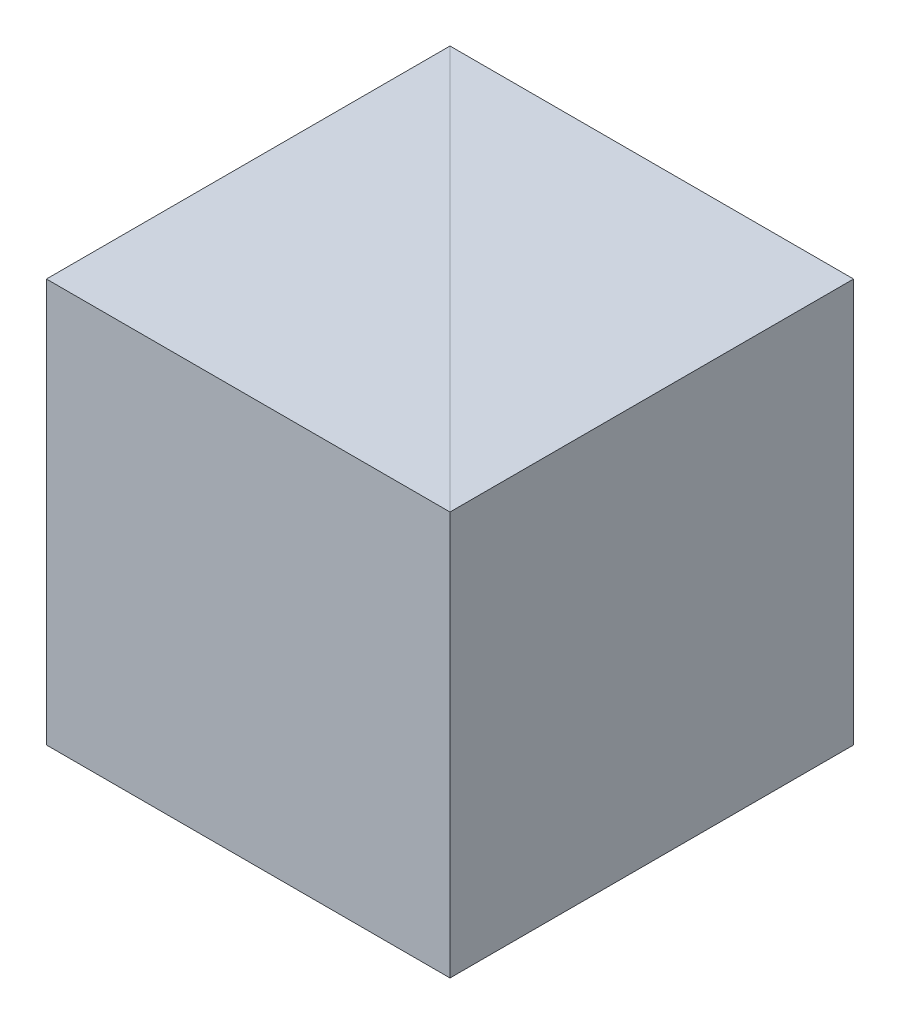
ISO-10303-21;
HEADER;
FILE_DESCRIPTION(('STEP AP214'),'2;1');
FILE_NAME('part.step','',(''),(''),'','','');
FILE_SCHEMA(('AUTOMOTIVE_DESIGN { 1 0 10303 214 1 1 1 1 }'));
ENDSEC;
DATA;
#1=APPLICATION_CONTEXT('core data for automotive mechanical design processes');
#2=APPLICATION_PROTOCOL_DEFINITION('international standard','automotive_design',2000,#1);
#3=PRODUCT_CONTEXT('',#1,'mechanical');
#4=PRODUCT('Part','Part','',(#3));
#5=PRODUCT_RELATED_PRODUCT_CATEGORY('part','',(#4));
#6=PRODUCT_DEFINITION_FORMATION('','',#4);
#7=PRODUCT_DEFINITION_CONTEXT('part definition',#1,'design');
#8=PRODUCT_DEFINITION('design','',#6,#7);
#9=PRODUCT_DEFINITION_SHAPE('','',#8);
#10=(LENGTH_UNIT() NAMED_UNIT(*) SI_UNIT(.MILLI.,.METRE.));
#11=(NAMED_UNIT(*) PLANE_ANGLE_UNIT() SI_UNIT($,.RADIAN.));
#12=(NAMED_UNIT(*) SI_UNIT($,.STERADIAN.) SOLID_ANGLE_UNIT());
#13=UNCERTAINTY_MEASURE_WITH_UNIT(LENGTH_MEASURE(1.E-05),#10,'distance_accuracy_value','');
#14=(GEOMETRIC_REPRESENTATION_CONTEXT(3) GLOBAL_UNCERTAINTY_ASSIGNED_CONTEXT((#13)) GLOBAL_UNIT_ASSIGNED_CONTEXT((#10,
#11,#12)) REPRESENTATION_CONTEXT('',''));
#15=CARTESIAN_POINT('',(0.,0.,0.));
#16=DIRECTION('',(0.,0.,1.));
#17=DIRECTION('',(1.,0.,0.));
#18=AXIS2_PLACEMENT_3D('',#15,#16,#17);
#19=CARTESIAN_POINT('',(0.,5.,0.));
#20=DIRECTION('',(0.707106781186547,0.,-0.707106781186548));
#21=DIRECTION('',(-0.707106781186548,0.,-0.707106781186547));
#22=AXIS2_PLACEMENT_3D('',#19,#20,#21);
#23=PLANE('',#22);
#24=DIRECTION('',(0.707106781186548,0.,0.707106781186547));
#25=VECTOR('',#24,1.);
#26=CARTESIAN_POINT('',(0.,0.,0.));
#27=LINE('',#26,#25);
#28=CARTESIAN_POINT('',(-5.,0.,-5.));
#29=VERTEX_POINT('',#28);
#30=CARTESIAN_POINT('',(0.,0.,0.));
#31=VERTEX_POINT('',#30);
#32=EDGE_CURVE('E97',#29,#31,#27,.T.);
#33=ORIENTED_EDGE('',*,*,#32,.F.);
#34=DIRECTION('',(0.,-1.,0.));
#35=VECTOR('',#34,1.);
#36=CARTESIAN_POINT('',(-5.,5.,-5.));
#37=LINE('',#36,#35);
#38=CARTESIAN_POINT('',(-5.,5.,-5.));
#39=VERTEX_POINT('',#38);
#40=EDGE_CURVE('E12',#39,#29,#37,.T.);
#41=ORIENTED_EDGE('',*,*,#40,.F.);
#42=DIRECTION('',(0.707106781186548,0.,0.707106781186547));
#43=VECTOR('',#42,1.);
#44=CARTESIAN_POINT('',(0.,5.,0.));
#45=LINE('',#44,#43);
#46=CARTESIAN_POINT('',(0.,5.,0.));
#47=VERTEX_POINT('',#46);
#48=EDGE_CURVE('E89',#39,#47,#45,.T.);
#49=ORIENTED_EDGE('',*,*,#48,.T.);
#50=DIRECTION('',(0.,-1.,0.));
#51=VECTOR('',#50,1.);
#52=CARTESIAN_POINT('',(0.,5.,0.));
#53=LINE('',#52,#51);
#54=EDGE_CURVE('E48',#47,#31,#53,.T.);
#55=ORIENTED_EDGE('',*,*,#54,.T.);
#56=EDGE_LOOP('',(#33,#41,#49,#55));
#57=FACE_BOUND('',#56,.T.);
#58=ADVANCED_FACE('F45',(#57),#23,.T.);
#59=CARTESIAN_POINT('',(-5.,5.,-5.));
#60=DIRECTION('',(-1.,0.,0.));
#61=DIRECTION('',(0.,0.,1.));
#62=AXIS2_PLACEMENT_3D('',#59,#60,#61);
#63=PLANE('',#62);
#64=DIRECTION('',(0.,0.,-1.));
#65=VECTOR('',#64,1.);
#66=CARTESIAN_POINT('',(-5.,0.,-5.));
#67=LINE('',#66,#65);
#68=CARTESIAN_POINT('',(-5.,0.,0.));
#69=VERTEX_POINT('',#68);
#70=EDGE_CURVE('E91',#69,#29,#67,.T.);
#71=ORIENTED_EDGE('',*,*,#70,.F.);
#72=DIRECTION('',(0.,-1.,0.));
#73=VECTOR('',#72,1.);
#74=CARTESIAN_POINT('',(-5.,5.,0.));
#75=LINE('',#74,#73);
#76=CARTESIAN_POINT('',(-5.,5.,0.));
#77=VERTEX_POINT('',#76);
#78=EDGE_CURVE('E54',#77,#69,#75,.T.);
#79=ORIENTED_EDGE('',*,*,#78,.F.);
#80=DIRECTION('',(0.,0.,-1.));
#81=VECTOR('',#80,1.);
#82=CARTESIAN_POINT('',(-5.,5.,-5.));
#83=LINE('',#82,#81);
#84=EDGE_CURVE('E86',#77,#39,#83,.T.);
#85=ORIENTED_EDGE('',*,*,#84,.T.);
#86=ORIENTED_EDGE('',*,*,#40,.T.);
#87=EDGE_LOOP('',(#71,#79,#85,#86));
#88=FACE_BOUND('',#87,.T.);
#89=ADVANCED_FACE('F101',(#88),#63,.T.);
#90=CARTESIAN_POINT('',(-5.,5.,0.));
#91=DIRECTION('',(0.,0.,1.));
#92=DIRECTION('',(1.,0.,0.));
#93=AXIS2_PLACEMENT_3D('',#90,#91,#92);
#94=PLANE('',#93);
#95=DIRECTION('',(-1.,0.,0.));
#96=VECTOR('',#95,1.);
#97=CARTESIAN_POINT('',(-5.,0.,0.));
#98=LINE('',#97,#96);
#99=EDGE_CURVE('E84',#31,#69,#98,.T.);
#100=ORIENTED_EDGE('',*,*,#99,.F.);
#101=ORIENTED_EDGE('',*,*,#54,.F.);
#102=DIRECTION('',(-1.,0.,0.));
#103=VECTOR('',#102,1.);
#104=CARTESIAN_POINT('',(-5.,5.,0.));
#105=LINE('',#104,#103);
#106=EDGE_CURVE('E82',#47,#77,#105,.T.);
#107=ORIENTED_EDGE('',*,*,#106,.T.);
#108=ORIENTED_EDGE('',*,*,#78,.T.);
#109=EDGE_LOOP('',(#100,#101,#107,#108));
#110=FACE_BOUND('',#109,.T.);
#111=ADVANCED_FACE('F81',(#110),#94,.T.);
#112=CARTESIAN_POINT('',(0.,5.,0.));
#113=DIRECTION('',(0.,1.,0.));
#114=DIRECTION('',(0.,0.,1.));
#115=AXIS2_PLACEMENT_3D('',#112,#113,#114);
#116=PLANE('',#115);
#117=ORIENTED_EDGE('',*,*,#48,.F.);
#118=ORIENTED_EDGE('',*,*,#84,.F.);
#119=ORIENTED_EDGE('',*,*,#106,.F.);
#120=EDGE_LOOP('',(#117,#118,#119));
#121=FACE_BOUND('',#120,.T.);
#122=ADVANCED_FACE('F88',(#121),#116,.T.);
#123=CARTESIAN_POINT('',(0.,0.,0.));
#124=DIRECTION('',(0.,1.,0.));
#125=DIRECTION('',(0.,0.,1.));
#126=AXIS2_PLACEMENT_3D('',#123,#124,#125);
#127=PLANE('',#126);
#128=ORIENTED_EDGE('',*,*,#32,.T.);
#129=ORIENTED_EDGE('',*,*,#99,.T.);
#130=ORIENTED_EDGE('',*,*,#70,.T.);
#131=EDGE_LOOP('',(#128,#129,#130));
#132=FACE_BOUND('',#131,.T.);
#133=ADVANCED_FACE('F100',(#132),#127,.F.);
#134=CLOSED_SHELL('',(#58,#89,#111,#122,#133));
#135=MANIFOLD_SOLID_BREP('B2',#134);
#136=CARTESIAN_POINT('',(-5.,5.,-5.));
#137=DIRECTION('',(0.707106781186547,0.,-0.707106781186548));
#138=DIRECTION('',(-0.707106781186548,0.,-0.707106781186547));
#139=AXIS2_PLACEMENT_3D('',#136,#137,#138);
#140=PLANE('',#139);
#141=DIRECTION('',(0.707106781186548,0.,0.707106781186547));
#142=VECTOR('',#141,1.);
#143=CARTESIAN_POINT('',(-5.,0.,-5.));
#144=LINE('',#143,#142);
#145=CARTESIAN_POINT('',(-5.,0.,-5.));
#146=VERTEX_POINT('',#145);
#147=CARTESIAN_POINT('',(0.,0.,0.));
#148=VERTEX_POINT('',#147);
#149=EDGE_CURVE('E190',#146,#148,#144,.T.);
#150=ORIENTED_EDGE('',*,*,#149,.T.);
#151=DIRECTION('',(0.,-1.,0.));
#152=VECTOR('',#151,1.);
#153=CARTESIAN_POINT('',(0.,5.,0.));
#154=LINE('',#153,#152);
#155=CARTESIAN_POINT('',(0.,5.,0.));
#156=VERTEX_POINT('',#155);
#157=EDGE_CURVE('E43',#156,#148,#154,.T.);
#158=ORIENTED_EDGE('',*,*,#157,.F.);
#159=DIRECTION('',(0.707106781186548,0.,0.707106781186547));
#160=VECTOR('',#159,1.);
#161=CARTESIAN_POINT('',(-5.,5.,-5.));
#162=LINE('',#161,#160);
#163=CARTESIAN_POINT('',(-5.,5.,-5.));
#164=VERTEX_POINT('',#163);
#165=EDGE_CURVE('E183',#164,#156,#162,.T.);
#166=ORIENTED_EDGE('',*,*,#165,.F.);
#167=DIRECTION('',(0.,-1.,0.));
#168=VECTOR('',#167,1.);
#169=CARTESIAN_POINT('',(-5.,5.,-5.));
#170=LINE('',#169,#168);
#171=EDGE_CURVE('E191',#164,#146,#170,.T.);
#172=ORIENTED_EDGE('',*,*,#171,.T.);
#173=EDGE_LOOP('',(#150,#158,#166,#172));
#174=FACE_BOUND('',#173,.T.);
#175=ADVANCED_FACE('F143',(#174),#140,.F.);
#176=CARTESIAN_POINT('',(0.,5.,0.));
#177=DIRECTION('',(-1.,0.,0.));
#178=DIRECTION('',(0.,0.,1.));
#179=AXIS2_PLACEMENT_3D('',#176,#177,#178);
#180=PLANE('',#179);
#181=DIRECTION('',(0.,0.,-1.));
#182=VECTOR('',#181,1.);
#183=CARTESIAN_POINT('',(0.,0.,0.));
#184=LINE('',#183,#182);
#185=CARTESIAN_POINT('',(0.,0.,-5.));
#186=VERTEX_POINT('',#185);
#187=EDGE_CURVE('E171',#148,#186,#184,.T.);
#188=ORIENTED_EDGE('',*,*,#187,.T.);
#189=DIRECTION('',(0.,-1.,0.));
#190=VECTOR('',#189,1.);
#191=CARTESIAN_POINT('',(0.,5.,-5.));
#192=LINE('',#191,#190);
#193=CARTESIAN_POINT('',(0.,5.,-5.));
#194=VERTEX_POINT('',#193);
#195=EDGE_CURVE('E151',#194,#186,#192,.T.);
#196=ORIENTED_EDGE('',*,*,#195,.F.);
#197=DIRECTION('',(0.,0.,-1.));
#198=VECTOR('',#197,1.);
#199=CARTESIAN_POINT('',(0.,5.,0.));
#200=LINE('',#199,#198);
#201=EDGE_CURVE('E179',#156,#194,#200,.T.);
#202=ORIENTED_EDGE('',*,*,#201,.F.);
#203=ORIENTED_EDGE('',*,*,#157,.T.);
#204=EDGE_LOOP('',(#188,#196,#202,#203));
#205=FACE_BOUND('',#204,.T.);
#206=ADVANCED_FACE('F180',(#205),#180,.F.);
#207=CARTESIAN_POINT('',(0.,5.,-5.));
#208=DIRECTION('',(0.,0.,1.));
#209=DIRECTION('',(1.,0.,0.));
#210=AXIS2_PLACEMENT_3D('',#207,#208,#209);
#211=PLANE('',#210);
#212=DIRECTION('',(-1.,0.,0.));
#213=VECTOR('',#212,1.);
#214=CARTESIAN_POINT('',(0.,0.,-5.));
#215=LINE('',#214,#213);
#216=EDGE_CURVE('E176',#186,#146,#215,.T.);
#217=ORIENTED_EDGE('',*,*,#216,.T.);
#218=ORIENTED_EDGE('',*,*,#171,.F.);
#219=DIRECTION('',(-1.,0.,0.));
#220=VECTOR('',#219,1.);
#221=CARTESIAN_POINT('',(0.,5.,-5.));
#222=LINE('',#221,#220);
#223=EDGE_CURVE('E159',#194,#164,#222,.T.);
#224=ORIENTED_EDGE('',*,*,#223,.F.);
#225=ORIENTED_EDGE('',*,*,#195,.T.);
#226=EDGE_LOOP('',(#217,#218,#224,#225));
#227=FACE_BOUND('',#226,.T.);
#228=ADVANCED_FACE('F198',(#227),#211,.F.);
#229=CARTESIAN_POINT('',(0.,5.,0.));
#230=DIRECTION('',(0.,1.,0.));
#231=DIRECTION('',(0.,0.,1.));
#232=AXIS2_PLACEMENT_3D('',#229,#230,#231);
#233=PLANE('',#232);
#234=ORIENTED_EDGE('',*,*,#165,.T.);
#235=ORIENTED_EDGE('',*,*,#201,.T.);
#236=ORIENTED_EDGE('',*,*,#223,.T.);
#237=EDGE_LOOP('',(#234,#235,#236));
#238=FACE_BOUND('',#237,.T.);
#239=ADVANCED_FACE('F186',(#238),#233,.T.);
#240=CARTESIAN_POINT('',(0.,0.,0.));
#241=DIRECTION('',(0.,1.,0.));
#242=DIRECTION('',(0.,0.,1.));
#243=AXIS2_PLACEMENT_3D('',#240,#241,#242);
#244=PLANE('',#243);
#245=ORIENTED_EDGE('',*,*,#149,.F.);
#246=ORIENTED_EDGE('',*,*,#216,.F.);
#247=ORIENTED_EDGE('',*,*,#187,.F.);
#248=EDGE_LOOP('',(#245,#246,#247));
#249=FACE_BOUND('',#248,.T.);
#250=ADVANCED_FACE('F199',(#249),#244,.F.);
#251=CLOSED_SHELL('',(#175,#206,#228,#239,#250));
#252=MANIFOLD_SOLID_BREP('B6',#251);
#253=ADVANCED_BREP_SHAPE_REPRESENTATION('',(#18,#135,#252),#14);
#254=SHAPE_DEFINITION_REPRESENTATION(#9,#253);
ENDSEC;
END-ISO-10303-21;
